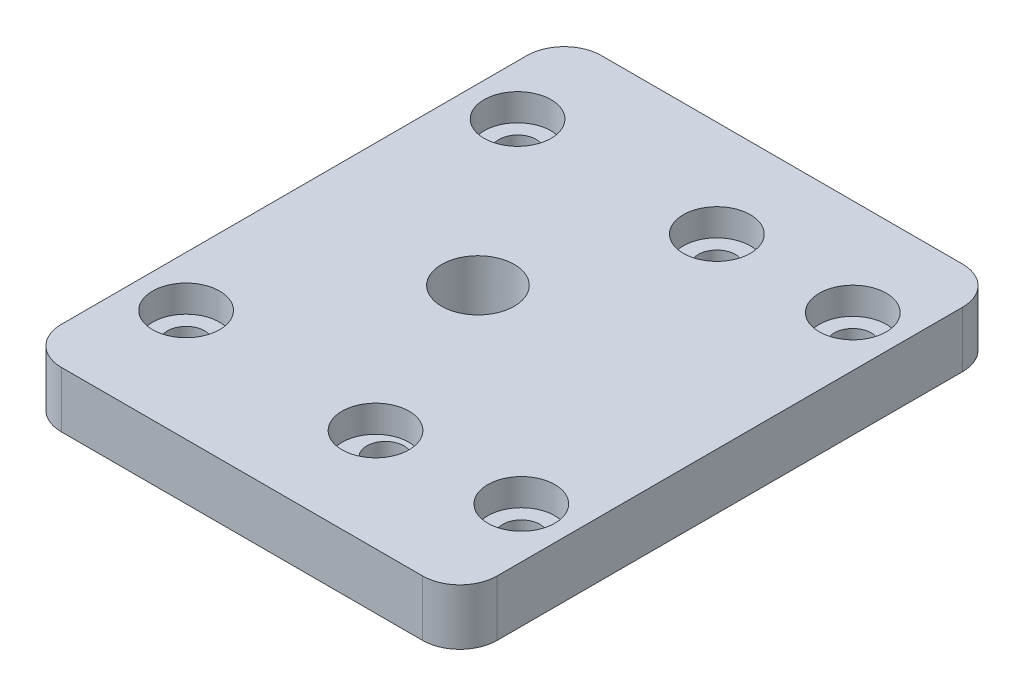
ISO-10303-21;
HEADER;
FILE_DESCRIPTION(('STEP AP214'),'2;1');
FILE_NAME('part.step','',(''),(''),'','','');
FILE_SCHEMA(('AUTOMOTIVE_DESIGN { 1 0 10303 214 1 1 1 1 }'));
ENDSEC;
DATA;
#1=APPLICATION_CONTEXT('core data for automotive mechanical design processes');
#2=APPLICATION_PROTOCOL_DEFINITION('international standard','automotive_design',2000,#1);
#3=PRODUCT_CONTEXT('',#1,'mechanical');
#4=PRODUCT('Part','Part','',(#3));
#5=PRODUCT_RELATED_PRODUCT_CATEGORY('part','',(#4));
#6=PRODUCT_DEFINITION_FORMATION('','',#4);
#7=PRODUCT_DEFINITION_CONTEXT('part definition',#1,'design');
#8=PRODUCT_DEFINITION('design','',#6,#7);
#9=PRODUCT_DEFINITION_SHAPE('','',#8);
#10=(LENGTH_UNIT() NAMED_UNIT(*) SI_UNIT(.MILLI.,.METRE.));
#11=(NAMED_UNIT(*) PLANE_ANGLE_UNIT() SI_UNIT($,.RADIAN.));
#12=(NAMED_UNIT(*) SI_UNIT($,.STERADIAN.) SOLID_ANGLE_UNIT());
#13=UNCERTAINTY_MEASURE_WITH_UNIT(LENGTH_MEASURE(1.E-05),#10,'distance_accuracy_value','');
#14=(GEOMETRIC_REPRESENTATION_CONTEXT(3) GLOBAL_UNCERTAINTY_ASSIGNED_CONTEXT((#13)) GLOBAL_UNIT_ASSIGNED_CONTEXT((#10,
#11,#12)) REPRESENTATION_CONTEXT('',''));
#15=CARTESIAN_POINT('',(0.,0.,0.));
#16=DIRECTION('',(0.,0.,1.));
#17=DIRECTION('',(1.,0.,0.));
#18=AXIS2_PLACEMENT_3D('',#15,#16,#17);
#19=CARTESIAN_POINT('',(-9.,-7.,-9.3));
#20=DIRECTION('',(0.,1.,0.));
#21=DIRECTION('',(0.,0.,1.));
#22=AXIS2_PLACEMENT_3D('',#19,#20,#21);
#23=CYLINDRICAL_SURFACE('',#22,1.);
#24=CARTESIAN_POINT('',(-9.,0.,-9.3));
#25=DIRECTION('',(0.,-1.,0.));
#26=DIRECTION('',(0.,0.,-1.));
#27=AXIS2_PLACEMENT_3D('',#24,#25,#26);
#28=CIRCLE('',#27,1.);
#29=CARTESIAN_POINT('',(-9.,0.,-10.3));
#30=VERTEX_POINT('',#29);
#31=EDGE_CURVE('E169',#30,#30,#28,.T.);
#32=ORIENTED_EDGE('',*,*,#31,.T.);
#33=EDGE_LOOP('',(#32));
#34=FACE_BOUND('',#33,.T.);
#35=CARTESIAN_POINT('',(-9.,1.55,-9.3));
#36=DIRECTION('',(0.,1.,0.));
#37=DIRECTION('',(0.,0.,1.));
#38=AXIS2_PLACEMENT_3D('',#35,#36,#37);
#39=CIRCLE('',#38,1.);
#40=CARTESIAN_POINT('',(-9.,1.55,-8.3));
#41=VERTEX_POINT('',#40);
#42=EDGE_CURVE('E40',#41,#41,#39,.F.);
#43=ORIENTED_EDGE('',*,*,#42,.F.);
#44=EDGE_LOOP('',(#43));
#45=FACE_BOUND('',#44,.T.);
#46=ADVANCED_FACE('F36',(#34,#45),#23,.F.);
#47=CARTESIAN_POINT('',(1.7,-7.,-9.3));
#48=DIRECTION('',(0.,1.,0.));
#49=DIRECTION('',(0.,0.,1.));
#50=AXIS2_PLACEMENT_3D('',#47,#48,#49);
#51=CYLINDRICAL_SURFACE('',#50,1.);
#52=CARTESIAN_POINT('',(1.7,0.,-9.3));
#53=DIRECTION('',(0.,-1.,0.));
#54=DIRECTION('',(0.,0.,-1.));
#55=AXIS2_PLACEMENT_3D('',#52,#53,#54);
#56=CIRCLE('',#55,1.);
#57=CARTESIAN_POINT('',(1.7,0.,-10.3));
#58=VERTEX_POINT('',#57);
#59=EDGE_CURVE('E165',#58,#58,#56,.T.);
#60=ORIENTED_EDGE('',*,*,#59,.T.);
#61=EDGE_LOOP('',(#60));
#62=FACE_BOUND('',#61,.T.);
#63=CARTESIAN_POINT('',(1.7,1.55,-9.3));
#64=DIRECTION('',(0.,1.,0.));
#65=DIRECTION('',(0.,0.,1.));
#66=AXIS2_PLACEMENT_3D('',#63,#64,#65);
#67=CIRCLE('',#66,1.);
#68=CARTESIAN_POINT('',(1.7,1.55,-8.3));
#69=VERTEX_POINT('',#68);
#70=EDGE_CURVE('E194',#69,#69,#67,.F.);
#71=ORIENTED_EDGE('',*,*,#70,.F.);
#72=EDGE_LOOP('',(#71));
#73=FACE_BOUND('',#72,.T.);
#74=ADVANCED_FACE('F273',(#62,#73),#51,.F.);
#75=CARTESIAN_POINT('',(9.,3.,-9.3));
#76=DIRECTION('',(0.,-1.,0.));
#77=DIRECTION('',(0.,0.,-1.));
#78=AXIS2_PLACEMENT_3D('',#75,#76,#77);
#79=CYLINDRICAL_SURFACE('',#78,1.);
#80=CARTESIAN_POINT('',(9.,0.,-9.3));
#81=DIRECTION('',(0.,1.,0.));
#82=DIRECTION('',(0.,0.,1.));
#83=AXIS2_PLACEMENT_3D('',#80,#81,#82);
#84=CIRCLE('',#83,1.);
#85=CARTESIAN_POINT('',(9.,0.,-8.3));
#86=VERTEX_POINT('',#85);
#87=EDGE_CURVE('E231',#86,#86,#84,.T.);
#88=ORIENTED_EDGE('',*,*,#87,.F.);
#89=EDGE_LOOP('',(#88));
#90=FACE_BOUND('',#89,.T.);
#91=CARTESIAN_POINT('',(9.,1.55,-9.3));
#92=DIRECTION('',(0.,1.,0.));
#93=DIRECTION('',(0.,0.,1.));
#94=AXIS2_PLACEMENT_3D('',#91,#92,#93);
#95=CIRCLE('',#94,1.);
#96=CARTESIAN_POINT('',(9.,1.55,-8.3));
#97=VERTEX_POINT('',#96);
#98=EDGE_CURVE('E190',#97,#97,#95,.T.);
#99=ORIENTED_EDGE('',*,*,#98,.T.);
#100=EDGE_LOOP('',(#99));
#101=FACE_BOUND('',#100,.T.);
#102=ADVANCED_FACE('F279',(#90,#101),#79,.F.);
#103=CARTESIAN_POINT('',(9.,3.,8.5));
#104=DIRECTION('',(0.,-1.,0.));
#105=DIRECTION('',(0.,0.,-1.));
#106=AXIS2_PLACEMENT_3D('',#103,#104,#105);
#107=CYLINDRICAL_SURFACE('',#106,1.);
#108=CARTESIAN_POINT('',(9.,0.,8.5));
#109=DIRECTION('',(0.,1.,0.));
#110=DIRECTION('',(0.,0.,-1.));
#111=AXIS2_PLACEMENT_3D('',#108,#109,#110);
#112=CIRCLE('',#111,1.);
#113=CARTESIAN_POINT('',(9.,0.,7.5));
#114=VERTEX_POINT('',#113);
#115=EDGE_CURVE('E137',#114,#114,#112,.T.);
#116=ORIENTED_EDGE('',*,*,#115,.F.);
#117=EDGE_LOOP('',(#116));
#118=FACE_BOUND('',#117,.T.);
#119=CARTESIAN_POINT('',(9.,1.55,8.5));
#120=DIRECTION('',(0.,1.,0.));
#121=DIRECTION('',(0.,0.,1.));
#122=AXIS2_PLACEMENT_3D('',#119,#120,#121);
#123=CIRCLE('',#122,1.);
#124=CARTESIAN_POINT('',(9.,1.55,9.5));
#125=VERTEX_POINT('',#124);
#126=EDGE_CURVE('E185',#125,#125,#123,.T.);
#127=ORIENTED_EDGE('',*,*,#126,.T.);
#128=EDGE_LOOP('',(#127));
#129=FACE_BOUND('',#128,.T.);
#130=ADVANCED_FACE('F289',(#118,#129),#107,.F.);
#131=CARTESIAN_POINT('',(1.7,3.,8.5));
#132=DIRECTION('',(0.,-1.,0.));
#133=DIRECTION('',(0.,0.,-1.));
#134=AXIS2_PLACEMENT_3D('',#131,#132,#133);
#135=CYLINDRICAL_SURFACE('',#134,1.);
#136=CARTESIAN_POINT('',(1.7,0.,8.5));
#137=DIRECTION('',(0.,1.,0.));
#138=DIRECTION('',(0.,0.,-1.));
#139=AXIS2_PLACEMENT_3D('',#136,#137,#138);
#140=CIRCLE('',#139,1.);
#141=CARTESIAN_POINT('',(1.7,0.,7.5));
#142=VERTEX_POINT('',#141);
#143=EDGE_CURVE('E168',#142,#142,#140,.T.);
#144=ORIENTED_EDGE('',*,*,#143,.F.);
#145=EDGE_LOOP('',(#144));
#146=FACE_BOUND('',#145,.T.);
#147=CARTESIAN_POINT('',(1.7,1.55,8.5));
#148=DIRECTION('',(0.,1.,0.));
#149=DIRECTION('',(0.,0.,1.));
#150=AXIS2_PLACEMENT_3D('',#147,#148,#149);
#151=CIRCLE('',#150,1.);
#152=CARTESIAN_POINT('',(1.7,1.55,9.5));
#153=VERTEX_POINT('',#152);
#154=EDGE_CURVE('E180',#153,#153,#151,.T.);
#155=ORIENTED_EDGE('',*,*,#154,.T.);
#156=EDGE_LOOP('',(#155));
#157=FACE_BOUND('',#156,.T.);
#158=ADVANCED_FACE('F285',(#146,#157),#135,.F.);
#159=CARTESIAN_POINT('',(-9.,3.,8.5));
#160=DIRECTION('',(0.,-1.,0.));
#161=DIRECTION('',(0.,0.,-1.));
#162=AXIS2_PLACEMENT_3D('',#159,#160,#161);
#163=CYLINDRICAL_SURFACE('',#162,1.);
#164=CARTESIAN_POINT('',(-9.,0.,8.5));
#165=DIRECTION('',(0.,1.,0.));
#166=DIRECTION('',(0.,0.,-1.));
#167=AXIS2_PLACEMENT_3D('',#164,#165,#166);
#168=CIRCLE('',#167,1.);
#169=CARTESIAN_POINT('',(-9.,0.,7.5));
#170=VERTEX_POINT('',#169);
#171=EDGE_CURVE('E234',#170,#170,#168,.T.);
#172=ORIENTED_EDGE('',*,*,#171,.F.);
#173=EDGE_LOOP('',(#172));
#174=FACE_BOUND('',#173,.T.);
#175=CARTESIAN_POINT('',(-9.,1.55,8.5));
#176=DIRECTION('',(0.,1.,0.));
#177=DIRECTION('',(0.,0.,1.));
#178=AXIS2_PLACEMENT_3D('',#175,#176,#177);
#179=CIRCLE('',#178,1.);
#180=CARTESIAN_POINT('',(-9.,1.55,9.5));
#181=VERTEX_POINT('',#180);
#182=EDGE_CURVE('E176',#181,#181,#179,.T.);
#183=ORIENTED_EDGE('',*,*,#182,.T.);
#184=EDGE_LOOP('',(#183));
#185=FACE_BOUND('',#184,.T.);
#186=ADVANCED_FACE('F288',(#174,#185),#163,.F.);
#187=CARTESIAN_POINT('',(0.,3.,0.));
#188=DIRECTION('',(0.,-1.,0.));
#189=DIRECTION('',(0.,0.,-1.));
#190=AXIS2_PLACEMENT_3D('',#187,#188,#189);
#191=PLANE('',#190);
#192=CARTESIAN_POINT('',(-9.,3.,-9.3));
#193=DIRECTION('',(0.,1.,0.));
#194=DIRECTION('',(0.,0.,1.));
#195=AXIS2_PLACEMENT_3D('',#192,#193,#194);
#196=CIRCLE('',#195,1.8);
#197=CARTESIAN_POINT('',(-9.,3.,-7.5));
#198=VERTEX_POINT('',#197);
#199=EDGE_CURVE('E210',#198,#198,#196,.T.);
#200=ORIENTED_EDGE('',*,*,#199,.F.);
#201=EDGE_LOOP('',(#200));
#202=FACE_BOUND('',#201,.T.);
#203=CARTESIAN_POINT('',(1.7,3.,-9.3));
#204=DIRECTION('',(0.,1.,0.));
#205=DIRECTION('',(0.,0.,1.));
#206=AXIS2_PLACEMENT_3D('',#203,#204,#205);
#207=CIRCLE('',#206,1.8);
#208=CARTESIAN_POINT('',(1.7,3.,-7.5));
#209=VERTEX_POINT('',#208);
#210=EDGE_CURVE('E203',#209,#209,#207,.T.);
#211=ORIENTED_EDGE('',*,*,#210,.F.);
#212=EDGE_LOOP('',(#211));
#213=FACE_BOUND('',#212,.T.);
#214=CARTESIAN_POINT('',(9.,3.,-9.3));
#215=DIRECTION('',(0.,1.,0.));
#216=DIRECTION('',(0.,0.,1.));
#217=AXIS2_PLACEMENT_3D('',#214,#215,#216);
#218=CIRCLE('',#217,1.8);
#219=CARTESIAN_POINT('',(9.,3.,-7.5));
#220=VERTEX_POINT('',#219);
#221=EDGE_CURVE('E196',#220,#220,#218,.T.);
#222=ORIENTED_EDGE('',*,*,#221,.F.);
#223=EDGE_LOOP('',(#222));
#224=FACE_BOUND('',#223,.T.);
#225=CARTESIAN_POINT('',(9.,3.,8.5));
#226=DIRECTION('',(0.,1.,0.));
#227=DIRECTION('',(0.,0.,1.));
#228=AXIS2_PLACEMENT_3D('',#225,#226,#227);
#229=CIRCLE('',#228,1.8);
#230=CARTESIAN_POINT('',(9.,3.,10.3));
#231=VERTEX_POINT('',#230);
#232=EDGE_CURVE('E192',#231,#231,#229,.T.);
#233=ORIENTED_EDGE('',*,*,#232,.F.);
#234=EDGE_LOOP('',(#233));
#235=FACE_BOUND('',#234,.T.);
#236=CARTESIAN_POINT('',(1.67182258337982,3.,9.00000000000064));
#237=DIRECTION('',(0.,1.,0.));
#238=DIRECTION('',(0.,0.,1.));
#239=AXIS2_PLACEMENT_3D('',#236,#237,#238);
#240=CIRCLE('',#239,1.8);
#241=CARTESIAN_POINT('',(1.67182258337982,3.,10.8000000000006));
#242=VERTEX_POINT('',#241);
#243=EDGE_CURVE('E188',#242,#242,#240,.T.);
#244=ORIENTED_EDGE('',*,*,#243,.F.);
#245=EDGE_LOOP('',(#244));
#246=FACE_BOUND('',#245,.T.);
#247=CARTESIAN_POINT('',(-9.,3.,8.5));
#248=DIRECTION('',(0.,1.,0.));
#249=DIRECTION('',(0.,0.,1.));
#250=AXIS2_PLACEMENT_3D('',#247,#248,#249);
#251=CIRCLE('',#250,1.8);
#252=CARTESIAN_POINT('',(-9.,3.,10.3));
#253=VERTEX_POINT('',#252);
#254=EDGE_CURVE('E183',#253,#253,#251,.T.);
#255=ORIENTED_EDGE('',*,*,#254,.F.);
#256=EDGE_LOOP('',(#255));
#257=FACE_BOUND('',#256,.T.);
#258=CARTESIAN_POINT('',(-2.3281774166205,3.,-0.499999999999999));
#259=DIRECTION('',(0.,1.,0.));
#260=DIRECTION('',(0.,0.,1.));
#261=AXIS2_PLACEMENT_3D('',#258,#259,#260);
#262=CIRCLE('',#261,1.95);
#263=CARTESIAN_POINT('',(-2.3281774166205,3.,1.45));
#264=VERTEX_POINT('',#263);
#265=EDGE_CURVE('E175',#264,#264,#262,.T.);
#266=ORIENTED_EDGE('',*,*,#265,.F.);
#267=EDGE_LOOP('',(#266));
#268=FACE_BOUND('',#267,.T.);
#269=DIRECTION('',(0.,0.,-1.));
#270=VECTOR('',#269,1.);
#271=CARTESIAN_POINT('',(11.7,3.,14.5));
#272=LINE('',#271,#270);
#273=CARTESIAN_POINT('',(11.7,3.,12.5));
#274=VERTEX_POINT('',#273);
#275=CARTESIAN_POINT('',(11.7,3.,-12.5));
#276=VERTEX_POINT('',#275);
#277=EDGE_CURVE('E142',#274,#276,#272,.T.);
#278=ORIENTED_EDGE('',*,*,#277,.T.);
#279=CARTESIAN_POINT('',(9.69999999999999,3.,-12.5));
#280=DIRECTION('',(0.,-1.,0.));
#281=DIRECTION('',(0.,0.,-1.));
#282=AXIS2_PLACEMENT_3D('',#279,#280,#281);
#283=CIRCLE('',#282,2.);
#284=CARTESIAN_POINT('',(9.69999999999999,3.,-14.5));
#285=VERTEX_POINT('',#284);
#286=EDGE_CURVE('E157',#276,#285,#283,.F.);
#287=ORIENTED_EDGE('',*,*,#286,.T.);
#288=DIRECTION('',(-1.,0.,0.));
#289=VECTOR('',#288,1.);
#290=CARTESIAN_POINT('',(-11.7,3.,-14.5));
#291=LINE('',#290,#289);
#292=CARTESIAN_POINT('',(-9.7,3.,-14.5));
#293=VERTEX_POINT('',#292);
#294=EDGE_CURVE('E124',#285,#293,#291,.T.);
#295=ORIENTED_EDGE('',*,*,#294,.T.);
#296=CARTESIAN_POINT('',(-9.7,3.,-12.5));
#297=DIRECTION('',(0.,-1.,0.));
#298=DIRECTION('',(0.,0.,-1.));
#299=AXIS2_PLACEMENT_3D('',#296,#297,#298);
#300=CIRCLE('',#299,2.);
#301=CARTESIAN_POINT('',(-11.7,3.,-12.5));
#302=VERTEX_POINT('',#301);
#303=EDGE_CURVE('E152',#293,#302,#300,.F.);
#304=ORIENTED_EDGE('',*,*,#303,.T.);
#305=DIRECTION('',(0.,0.,1.));
#306=VECTOR('',#305,1.);
#307=CARTESIAN_POINT('',(-11.7,3.,14.5));
#308=LINE('',#307,#306);
#309=CARTESIAN_POINT('',(-11.7,3.,12.5));
#310=VERTEX_POINT('',#309);
#311=EDGE_CURVE('E242',#302,#310,#308,.T.);
#312=ORIENTED_EDGE('',*,*,#311,.T.);
#313=CARTESIAN_POINT('',(-9.7,3.,12.5));
#314=DIRECTION('',(0.,-1.,0.));
#315=DIRECTION('',(0.,0.,-1.));
#316=AXIS2_PLACEMENT_3D('',#313,#314,#315);
#317=CIRCLE('',#316,2.);
#318=CARTESIAN_POINT('',(-9.7,3.,14.5));
#319=VERTEX_POINT('',#318);
#320=EDGE_CURVE('E60',#310,#319,#317,.F.);
#321=ORIENTED_EDGE('',*,*,#320,.T.);
#322=DIRECTION('',(1.,0.,0.));
#323=VECTOR('',#322,1.);
#324=CARTESIAN_POINT('',(-11.7,3.,14.5));
#325=LINE('',#324,#323);
#326=CARTESIAN_POINT('',(9.69999999999999,3.,14.5));
#327=VERTEX_POINT('',#326);
#328=EDGE_CURVE('E143',#319,#327,#325,.T.);
#329=ORIENTED_EDGE('',*,*,#328,.T.);
#330=CARTESIAN_POINT('',(9.7,3.,12.5));
#331=DIRECTION('',(0.,-1.,0.));
#332=DIRECTION('',(0.,0.,-1.));
#333=AXIS2_PLACEMENT_3D('',#330,#331,#332);
#334=CIRCLE('',#333,2.);
#335=EDGE_CURVE('E155',#327,#274,#334,.F.);
#336=ORIENTED_EDGE('',*,*,#335,.T.);
#337=EDGE_LOOP('',(#278,#287,#295,#304,#312,#321,#329,#336));
#338=FACE_BOUND('',#337,.T.);
#339=ADVANCED_FACE('F244',(#202,#213,#224,#235,#246,#257,#268,#338),#191,.F.);
#340=CARTESIAN_POINT('',(0.,0.,0.));
#341=DIRECTION('',(0.,-1.,0.));
#342=DIRECTION('',(0.,0.,-1.));
#343=AXIS2_PLACEMENT_3D('',#340,#341,#342);
#344=PLANE('',#343);
#345=CARTESIAN_POINT('',(-2.3281774166205,0.,-0.499999999999999));
#346=DIRECTION('',(0.,-1.,0.));
#347=DIRECTION('',(0.,0.,-1.));
#348=AXIS2_PLACEMENT_3D('',#345,#346,#347);
#349=CIRCLE('',#348,1.95);
#350=CARTESIAN_POINT('',(-2.3281774166205,0.,-2.45));
#351=VERTEX_POINT('',#350);
#352=EDGE_CURVE('E172',#351,#351,#349,.T.);
#353=ORIENTED_EDGE('',*,*,#352,.F.);
#354=EDGE_LOOP('',(#353));
#355=FACE_BOUND('',#354,.T.);
#356=ORIENTED_EDGE('',*,*,#31,.F.);
#357=EDGE_LOOP('',(#356));
#358=FACE_BOUND('',#357,.T.);
#359=ORIENTED_EDGE('',*,*,#59,.F.);
#360=EDGE_LOOP('',(#359));
#361=FACE_BOUND('',#360,.T.);
#362=ORIENTED_EDGE('',*,*,#87,.T.);
#363=EDGE_LOOP('',(#362));
#364=FACE_BOUND('',#363,.T.);
#365=ORIENTED_EDGE('',*,*,#115,.T.);
#366=EDGE_LOOP('',(#365));
#367=FACE_BOUND('',#366,.T.);
#368=DIRECTION('',(-1.,0.,0.));
#369=VECTOR('',#368,1.);
#370=CARTESIAN_POINT('',(-11.7,0.,-14.5));
#371=LINE('',#370,#369);
#372=CARTESIAN_POINT('',(9.69999999999999,0.,-14.5));
#373=VERTEX_POINT('',#372);
#374=CARTESIAN_POINT('',(-9.7,0.,-14.5));
#375=VERTEX_POINT('',#374);
#376=EDGE_CURVE('E121',#373,#375,#371,.T.);
#377=ORIENTED_EDGE('',*,*,#376,.F.);
#378=CARTESIAN_POINT('',(9.69999999999999,0.,-12.5));
#379=DIRECTION('',(0.,-1.,0.));
#380=DIRECTION('',(0.,0.,-1.));
#381=AXIS2_PLACEMENT_3D('',#378,#379,#380);
#382=CIRCLE('',#381,2.);
#383=CARTESIAN_POINT('',(11.7,0.,-12.5));
#384=VERTEX_POINT('',#383);
#385=EDGE_CURVE('E104',#373,#384,#382,.T.);
#386=ORIENTED_EDGE('',*,*,#385,.T.);
#387=DIRECTION('',(0.,0.,-1.));
#388=VECTOR('',#387,1.);
#389=CARTESIAN_POINT('',(11.7,0.,14.5));
#390=LINE('',#389,#388);
#391=CARTESIAN_POINT('',(11.7,0.,12.5));
#392=VERTEX_POINT('',#391);
#393=EDGE_CURVE('E132',#392,#384,#390,.T.);
#394=ORIENTED_EDGE('',*,*,#393,.F.);
#395=CARTESIAN_POINT('',(9.7,0.,12.5));
#396=DIRECTION('',(0.,-1.,0.));
#397=DIRECTION('',(0.,0.,-1.));
#398=AXIS2_PLACEMENT_3D('',#395,#396,#397);
#399=CIRCLE('',#398,2.);
#400=CARTESIAN_POINT('',(9.69999999999999,0.,14.5));
#401=VERTEX_POINT('',#400);
#402=EDGE_CURVE('E115',#392,#401,#399,.T.);
#403=ORIENTED_EDGE('',*,*,#402,.T.);
#404=DIRECTION('',(1.,0.,0.));
#405=VECTOR('',#404,1.);
#406=CARTESIAN_POINT('',(-11.7,0.,14.5));
#407=LINE('',#406,#405);
#408=CARTESIAN_POINT('',(-9.7,0.,14.5));
#409=VERTEX_POINT('',#408);
#410=EDGE_CURVE('E135',#409,#401,#407,.T.);
#411=ORIENTED_EDGE('',*,*,#410,.F.);
#412=CARTESIAN_POINT('',(-9.7,0.,12.5));
#413=DIRECTION('',(0.,-1.,0.));
#414=DIRECTION('',(0.,0.,-1.));
#415=AXIS2_PLACEMENT_3D('',#412,#413,#414);
#416=CIRCLE('',#415,2.);
#417=CARTESIAN_POINT('',(-11.7,0.,12.5));
#418=VERTEX_POINT('',#417);
#419=EDGE_CURVE('E146',#409,#418,#416,.T.);
#420=ORIENTED_EDGE('',*,*,#419,.T.);
#421=DIRECTION('',(0.,0.,1.));
#422=VECTOR('',#421,1.);
#423=CARTESIAN_POINT('',(-11.7,0.,14.5));
#424=LINE('',#423,#422);
#425=CARTESIAN_POINT('',(-11.7,0.,-12.5));
#426=VERTEX_POINT('',#425);
#427=EDGE_CURVE('E131',#426,#418,#424,.T.);
#428=ORIENTED_EDGE('',*,*,#427,.F.);
#429=CARTESIAN_POINT('',(-9.7,0.,-12.5));
#430=DIRECTION('',(0.,-1.,0.));
#431=DIRECTION('',(0.,0.,-1.));
#432=AXIS2_PLACEMENT_3D('',#429,#430,#431);
#433=CIRCLE('',#432,2.);
#434=EDGE_CURVE('E125',#426,#375,#433,.T.);
#435=ORIENTED_EDGE('',*,*,#434,.T.);
#436=EDGE_LOOP('',(#377,#386,#394,#403,#411,#420,#428,#435));
#437=FACE_BOUND('',#436,.T.);
#438=ORIENTED_EDGE('',*,*,#171,.T.);
#439=EDGE_LOOP('',(#438));
#440=FACE_BOUND('',#439,.T.);
#441=ORIENTED_EDGE('',*,*,#143,.T.);
#442=EDGE_LOOP('',(#441));
#443=FACE_BOUND('',#442,.T.);
#444=ADVANCED_FACE('F128',(#355,#358,#361,#364,#367,#437,#440,#443),#344,.T.);
#445=CARTESIAN_POINT('',(11.7,3.,14.5));
#446=DIRECTION('',(-1.,0.,0.));
#447=DIRECTION('',(0.,0.,1.));
#448=AXIS2_PLACEMENT_3D('',#445,#446,#447);
#449=PLANE('',#448);
#450=ORIENTED_EDGE('',*,*,#393,.T.);
#451=DIRECTION('',(0.,-1.,0.));
#452=VECTOR('',#451,1.);
#453=CARTESIAN_POINT('',(11.7,3.,-12.5));
#454=LINE('',#453,#452);
#455=EDGE_CURVE('E109',#384,#276,#454,.F.);
#456=ORIENTED_EDGE('',*,*,#455,.T.);
#457=ORIENTED_EDGE('',*,*,#277,.F.);
#458=DIRECTION('',(0.,-1.,0.));
#459=VECTOR('',#458,1.);
#460=CARTESIAN_POINT('',(11.7,3.,12.5));
#461=LINE('',#460,#459);
#462=EDGE_CURVE('E114',#274,#392,#461,.T.);
#463=ORIENTED_EDGE('',*,*,#462,.T.);
#464=EDGE_LOOP('',(#450,#456,#457,#463));
#465=FACE_BOUND('',#464,.T.);
#466=ADVANCED_FACE('F251',(#465),#449,.F.);
#467=CARTESIAN_POINT('',(-11.7,3.,-14.5));
#468=DIRECTION('',(0.,0.,1.));
#469=DIRECTION('',(1.,0.,0.));
#470=AXIS2_PLACEMENT_3D('',#467,#468,#469);
#471=PLANE('',#470);
#472=ORIENTED_EDGE('',*,*,#294,.F.);
#473=DIRECTION('',(0.,-1.,0.));
#474=VECTOR('',#473,1.);
#475=CARTESIAN_POINT('',(9.69999999999999,3.,-14.5));
#476=LINE('',#475,#474);
#477=EDGE_CURVE('E108',#285,#373,#476,.T.);
#478=ORIENTED_EDGE('',*,*,#477,.T.);
#479=ORIENTED_EDGE('',*,*,#376,.T.);
#480=DIRECTION('',(0.,-1.,0.));
#481=VECTOR('',#480,1.);
#482=CARTESIAN_POINT('',(-9.7,3.,-14.5));
#483=LINE('',#482,#481);
#484=EDGE_CURVE('E126',#375,#293,#483,.F.);
#485=ORIENTED_EDGE('',*,*,#484,.T.);
#486=EDGE_LOOP('',(#472,#478,#479,#485));
#487=FACE_BOUND('',#486,.T.);
#488=ADVANCED_FACE('F120',(#487),#471,.F.);
#489=CARTESIAN_POINT('',(-11.7,3.,14.5));
#490=DIRECTION('',(1.,0.,0.));
#491=DIRECTION('',(0.,0.,-1.));
#492=AXIS2_PLACEMENT_3D('',#489,#490,#491);
#493=PLANE('',#492);
#494=ORIENTED_EDGE('',*,*,#427,.T.);
#495=DIRECTION('',(0.,-1.,0.));
#496=VECTOR('',#495,1.);
#497=CARTESIAN_POINT('',(-11.7,3.,12.5));
#498=LINE('',#497,#496);
#499=EDGE_CURVE('E11',#418,#310,#498,.F.);
#500=ORIENTED_EDGE('',*,*,#499,.T.);
#501=ORIENTED_EDGE('',*,*,#311,.F.);
#502=DIRECTION('',(0.,-1.,0.));
#503=VECTOR('',#502,1.);
#504=CARTESIAN_POINT('',(-11.7,3.,-12.5));
#505=LINE('',#504,#503);
#506=EDGE_CURVE('E45',#302,#426,#505,.T.);
#507=ORIENTED_EDGE('',*,*,#506,.T.);
#508=EDGE_LOOP('',(#494,#500,#501,#507));
#509=FACE_BOUND('',#508,.T.);
#510=ADVANCED_FACE('F258',(#509),#493,.F.);
#511=CARTESIAN_POINT('',(-11.7,3.,14.5));
#512=DIRECTION('',(0.,0.,-1.));
#513=DIRECTION('',(-1.,0.,0.));
#514=AXIS2_PLACEMENT_3D('',#511,#512,#513);
#515=PLANE('',#514);
#516=ORIENTED_EDGE('',*,*,#410,.T.);
#517=DIRECTION('',(0.,-1.,0.));
#518=VECTOR('',#517,1.);
#519=CARTESIAN_POINT('',(9.69999999999999,3.,14.5));
#520=LINE('',#519,#518);
#521=EDGE_CURVE('E53',#401,#327,#520,.F.);
#522=ORIENTED_EDGE('',*,*,#521,.T.);
#523=ORIENTED_EDGE('',*,*,#328,.F.);
#524=DIRECTION('',(0.,-1.,0.));
#525=VECTOR('',#524,1.);
#526=CARTESIAN_POINT('',(-9.7,3.,14.5));
#527=LINE('',#526,#525);
#528=EDGE_CURVE('E159',#319,#409,#527,.T.);
#529=ORIENTED_EDGE('',*,*,#528,.T.);
#530=EDGE_LOOP('',(#516,#522,#523,#529));
#531=FACE_BOUND('',#530,.T.);
#532=ADVANCED_FACE('F253',(#531),#515,.F.);
#533=CARTESIAN_POINT('',(9.69999999999999,3.,-12.5));
#534=DIRECTION('',(0.,-1.,0.));
#535=DIRECTION('',(0.,0.,-1.));
#536=AXIS2_PLACEMENT_3D('',#533,#534,#535);
#537=CYLINDRICAL_SURFACE('',#536,2.);
#538=ORIENTED_EDGE('',*,*,#286,.F.);
#539=ORIENTED_EDGE('',*,*,#455,.F.);
#540=ORIENTED_EDGE('',*,*,#385,.F.);
#541=ORIENTED_EDGE('',*,*,#477,.F.);
#542=EDGE_LOOP('',(#538,#539,#540,#541));
#543=FACE_BOUND('',#542,.T.);
#544=ADVANCED_FACE('F107',(#543),#537,.T.);
#545=CARTESIAN_POINT('',(9.7,3.,12.5));
#546=DIRECTION('',(0.,-1.,0.));
#547=DIRECTION('',(0.,0.,-1.));
#548=AXIS2_PLACEMENT_3D('',#545,#546,#547);
#549=CYLINDRICAL_SURFACE('',#548,2.);
#550=ORIENTED_EDGE('',*,*,#335,.F.);
#551=ORIENTED_EDGE('',*,*,#521,.F.);
#552=ORIENTED_EDGE('',*,*,#402,.F.);
#553=ORIENTED_EDGE('',*,*,#462,.F.);
#554=EDGE_LOOP('',(#550,#551,#552,#553));
#555=FACE_BOUND('',#554,.T.);
#556=ADVANCED_FACE('F249',(#555),#549,.T.);
#557=CARTESIAN_POINT('',(-9.7,3.,12.5));
#558=DIRECTION('',(0.,-1.,0.));
#559=DIRECTION('',(0.,0.,-1.));
#560=AXIS2_PLACEMENT_3D('',#557,#558,#559);
#561=CYLINDRICAL_SURFACE('',#560,2.);
#562=ORIENTED_EDGE('',*,*,#320,.F.);
#563=ORIENTED_EDGE('',*,*,#499,.F.);
#564=ORIENTED_EDGE('',*,*,#419,.F.);
#565=ORIENTED_EDGE('',*,*,#528,.F.);
#566=EDGE_LOOP('',(#562,#563,#564,#565));
#567=FACE_BOUND('',#566,.T.);
#568=ADVANCED_FACE('F255',(#567),#561,.T.);
#569=CARTESIAN_POINT('',(-9.7,3.,-12.5));
#570=DIRECTION('',(0.,-1.,0.));
#571=DIRECTION('',(0.,0.,-1.));
#572=AXIS2_PLACEMENT_3D('',#569,#570,#571);
#573=CYLINDRICAL_SURFACE('',#572,2.);
#574=ORIENTED_EDGE('',*,*,#303,.F.);
#575=ORIENTED_EDGE('',*,*,#484,.F.);
#576=ORIENTED_EDGE('',*,*,#434,.F.);
#577=ORIENTED_EDGE('',*,*,#506,.F.);
#578=EDGE_LOOP('',(#574,#575,#576,#577));
#579=FACE_BOUND('',#578,.T.);
#580=ADVANCED_FACE('F38',(#579),#573,.T.);
#581=CARTESIAN_POINT('',(-2.3281774166205,-7.,-0.499999999999999));
#582=DIRECTION('',(0.,1.,0.));
#583=DIRECTION('',(0.,0.,1.));
#584=AXIS2_PLACEMENT_3D('',#581,#582,#583);
#585=CYLINDRICAL_SURFACE('',#584,1.95);
#586=ORIENTED_EDGE('',*,*,#352,.T.);
#587=EDGE_LOOP('',(#586));
#588=FACE_BOUND('',#587,.T.);
#589=ORIENTED_EDGE('',*,*,#265,.T.);
#590=EDGE_LOOP('',(#589));
#591=FACE_BOUND('',#590,.T.);
#592=ADVANCED_FACE('F264',(#588,#591),#585,.F.);
#593=CARTESIAN_POINT('',(-9.,1.55,8.5));
#594=DIRECTION('',(0.,1.,0.));
#595=DIRECTION('',(0.,0.,1.));
#596=AXIS2_PLACEMENT_3D('',#593,#594,#595);
#597=CYLINDRICAL_SURFACE('',#596,1.8);
#598=CARTESIAN_POINT('',(-9.,1.55,8.5));
#599=DIRECTION('',(0.,1.,0.));
#600=DIRECTION('',(0.,0.,1.));
#601=AXIS2_PLACEMENT_3D('',#598,#599,#600);
#602=CIRCLE('',#601,1.8);
#603=CARTESIAN_POINT('',(-9.,1.55,10.3));
#604=VERTEX_POINT('',#603);
#605=EDGE_CURVE('E179',#604,#604,#602,.T.);
#606=ORIENTED_EDGE('',*,*,#605,.F.);
#607=EDGE_LOOP('',(#606));
#608=FACE_BOUND('',#607,.T.);
#609=ORIENTED_EDGE('',*,*,#254,.T.);
#610=EDGE_LOOP('',(#609));
#611=FACE_BOUND('',#610,.T.);
#612=ADVANCED_FACE('F269',(#608,#611),#597,.F.);
#613=CARTESIAN_POINT('',(-9.,1.55,8.5));
#614=DIRECTION('',(0.,1.,0.));
#615=DIRECTION('',(0.,0.,1.));
#616=AXIS2_PLACEMENT_3D('',#613,#614,#615);
#617=PLANE('',#616);
#618=ORIENTED_EDGE('',*,*,#182,.F.);
#619=EDGE_LOOP('',(#618));
#620=FACE_BOUND('',#619,.T.);
#621=ORIENTED_EDGE('',*,*,#605,.T.);
#622=EDGE_LOOP('',(#621));
#623=FACE_BOUND('',#622,.T.);
#624=ADVANCED_FACE('F391',(#620,#623),#617,.T.);
#625=CARTESIAN_POINT('',(1.67182258337982,1.55,9.00000000000064));
#626=DIRECTION('',(0.,1.,0.));
#627=DIRECTION('',(0.,0.,1.));
#628=AXIS2_PLACEMENT_3D('',#625,#626,#627);
#629=CYLINDRICAL_SURFACE('',#628,1.8);
#630=CARTESIAN_POINT('',(1.67182258337982,1.55,9.00000000000064));
#631=DIRECTION('',(0.,1.,0.));
#632=DIRECTION('',(0.,0.,1.));
#633=AXIS2_PLACEMENT_3D('',#630,#631,#632);
#634=CIRCLE('',#633,1.8);
#635=CARTESIAN_POINT('',(1.67182258337982,1.55,10.8000000000006));
#636=VERTEX_POINT('',#635);
#637=EDGE_CURVE('E184',#636,#636,#634,.T.);
#638=ORIENTED_EDGE('',*,*,#637,.F.);
#639=EDGE_LOOP('',(#638));
#640=FACE_BOUND('',#639,.T.);
#641=ORIENTED_EDGE('',*,*,#243,.T.);
#642=EDGE_LOOP('',(#641));
#643=FACE_BOUND('',#642,.T.);
#644=ADVANCED_FACE('F400',(#640,#643),#629,.F.);
#645=CARTESIAN_POINT('',(1.67182258337982,1.55,9.00000000000064));
#646=DIRECTION('',(0.,1.,0.));
#647=DIRECTION('',(0.,0.,1.));
#648=AXIS2_PLACEMENT_3D('',#645,#646,#647);
#649=PLANE('',#648);
#650=ORIENTED_EDGE('',*,*,#154,.F.);
#651=EDGE_LOOP('',(#650));
#652=FACE_BOUND('',#651,.T.);
#653=ORIENTED_EDGE('',*,*,#637,.T.);
#654=EDGE_LOOP('',(#653));
#655=FACE_BOUND('',#654,.T.);
#656=ADVANCED_FACE('F410',(#652,#655),#649,.T.);
#657=CARTESIAN_POINT('',(9.,1.55,8.5));
#658=DIRECTION('',(0.,1.,0.));
#659=DIRECTION('',(0.,0.,1.));
#660=AXIS2_PLACEMENT_3D('',#657,#658,#659);
#661=CYLINDRICAL_SURFACE('',#660,1.8);
#662=CARTESIAN_POINT('',(9.,1.55,8.5));
#663=DIRECTION('',(0.,1.,0.));
#664=DIRECTION('',(0.,0.,1.));
#665=AXIS2_PLACEMENT_3D('',#662,#663,#664);
#666=CIRCLE('',#665,1.8);
#667=CARTESIAN_POINT('',(9.,1.55,10.3));
#668=VERTEX_POINT('',#667);
#669=EDGE_CURVE('E189',#668,#668,#666,.T.);
#670=ORIENTED_EDGE('',*,*,#669,.F.);
#671=EDGE_LOOP('',(#670));
#672=FACE_BOUND('',#671,.T.);
#673=ORIENTED_EDGE('',*,*,#232,.T.);
#674=EDGE_LOOP('',(#673));
#675=FACE_BOUND('',#674,.T.);
#676=ADVANCED_FACE('F420',(#672,#675),#661,.F.);
#677=CARTESIAN_POINT('',(9.,1.55,8.5));
#678=DIRECTION('',(0.,1.,0.));
#679=DIRECTION('',(0.,0.,1.));
#680=AXIS2_PLACEMENT_3D('',#677,#678,#679);
#681=PLANE('',#680);
#682=ORIENTED_EDGE('',*,*,#126,.F.);
#683=EDGE_LOOP('',(#682));
#684=FACE_BOUND('',#683,.T.);
#685=ORIENTED_EDGE('',*,*,#669,.T.);
#686=EDGE_LOOP('',(#685));
#687=FACE_BOUND('',#686,.T.);
#688=ADVANCED_FACE('F430',(#684,#687),#681,.T.);
#689=CARTESIAN_POINT('',(9.,1.55,-9.3));
#690=DIRECTION('',(0.,1.,0.));
#691=DIRECTION('',(0.,0.,1.));
#692=AXIS2_PLACEMENT_3D('',#689,#690,#691);
#693=CYLINDRICAL_SURFACE('',#692,1.8);
#694=CARTESIAN_POINT('',(9.,1.55,-9.3));
#695=DIRECTION('',(0.,1.,0.));
#696=DIRECTION('',(0.,0.,1.));
#697=AXIS2_PLACEMENT_3D('',#694,#695,#696);
#698=CIRCLE('',#697,1.8);
#699=CARTESIAN_POINT('',(9.,1.55,-7.5));
#700=VERTEX_POINT('',#699);
#701=EDGE_CURVE('E193',#700,#700,#698,.T.);
#702=ORIENTED_EDGE('',*,*,#701,.F.);
#703=EDGE_LOOP('',(#702));
#704=FACE_BOUND('',#703,.T.);
#705=ORIENTED_EDGE('',*,*,#221,.T.);
#706=EDGE_LOOP('',(#705));
#707=FACE_BOUND('',#706,.T.);
#708=ADVANCED_FACE('F440',(#704,#707),#693,.F.);
#709=CARTESIAN_POINT('',(9.,1.55,-9.3));
#710=DIRECTION('',(0.,1.,0.));
#711=DIRECTION('',(0.,0.,1.));
#712=AXIS2_PLACEMENT_3D('',#709,#710,#711);
#713=PLANE('',#712);
#714=ORIENTED_EDGE('',*,*,#98,.F.);
#715=EDGE_LOOP('',(#714));
#716=FACE_BOUND('',#715,.T.);
#717=ORIENTED_EDGE('',*,*,#701,.T.);
#718=EDGE_LOOP('',(#717));
#719=FACE_BOUND('',#718,.T.);
#720=ADVANCED_FACE('F450',(#716,#719),#713,.T.);
#721=CARTESIAN_POINT('',(1.7,1.55,-9.3));
#722=DIRECTION('',(0.,1.,0.));
#723=DIRECTION('',(0.,0.,1.));
#724=AXIS2_PLACEMENT_3D('',#721,#722,#723);
#725=PLANE('',#724);
#726=CARTESIAN_POINT('',(1.7,1.55,-9.3));
#727=DIRECTION('',(0.,1.,0.));
#728=DIRECTION('',(0.,0.,1.));
#729=AXIS2_PLACEMENT_3D('',#726,#727,#728);
#730=CIRCLE('',#729,1.8);
#731=CARTESIAN_POINT('',(1.7,1.55,-7.5));
#732=VERTEX_POINT('',#731);
#733=EDGE_CURVE('E197',#732,#732,#730,.T.);
#734=ORIENTED_EDGE('',*,*,#733,.T.);
#735=EDGE_LOOP('',(#734));
#736=FACE_BOUND('',#735,.T.);
#737=ORIENTED_EDGE('',*,*,#70,.T.);
#738=EDGE_LOOP('',(#737));
#739=FACE_BOUND('',#738,.T.);
#740=ADVANCED_FACE('F460',(#736,#739),#725,.T.);
#741=CARTESIAN_POINT('',(1.7,1.55,-9.3));
#742=DIRECTION('',(0.,1.,0.));
#743=DIRECTION('',(0.,0.,1.));
#744=AXIS2_PLACEMENT_3D('',#741,#742,#743);
#745=CYLINDRICAL_SURFACE('',#744,1.8);
#746=ORIENTED_EDGE('',*,*,#733,.F.);
#747=EDGE_LOOP('',(#746));
#748=FACE_BOUND('',#747,.T.);
#749=ORIENTED_EDGE('',*,*,#210,.T.);
#750=EDGE_LOOP('',(#749));
#751=FACE_BOUND('',#750,.T.);
#752=ADVANCED_FACE('F470',(#748,#751),#745,.F.);
#753=CARTESIAN_POINT('',(-9.,1.55,-9.3));
#754=DIRECTION('',(0.,1.,0.));
#755=DIRECTION('',(0.,0.,1.));
#756=AXIS2_PLACEMENT_3D('',#753,#754,#755);
#757=PLANE('',#756);
#758=CARTESIAN_POINT('',(-9.,1.55,-9.3));
#759=DIRECTION('',(0.,1.,0.));
#760=DIRECTION('',(0.,0.,1.));
#761=AXIS2_PLACEMENT_3D('',#758,#759,#760);
#762=CIRCLE('',#761,1.8);
#763=CARTESIAN_POINT('',(-9.,1.55,-7.5));
#764=VERTEX_POINT('',#763);
#765=EDGE_CURVE('E506',#764,#764,#762,.T.);
#766=ORIENTED_EDGE('',*,*,#765,.T.);
#767=EDGE_LOOP('',(#766));
#768=FACE_BOUND('',#767,.T.);
#769=ORIENTED_EDGE('',*,*,#42,.T.);
#770=EDGE_LOOP('',(#769));
#771=FACE_BOUND('',#770,.T.);
#772=ADVANCED_FACE('F479',(#768,#771),#757,.T.);
#773=CARTESIAN_POINT('',(-9.,1.55,-9.3));
#774=DIRECTION('',(0.,1.,0.));
#775=DIRECTION('',(0.,0.,1.));
#776=AXIS2_PLACEMENT_3D('',#773,#774,#775);
#777=CYLINDRICAL_SURFACE('',#776,1.8);
#778=ORIENTED_EDGE('',*,*,#765,.F.);
#779=EDGE_LOOP('',(#778));
#780=FACE_BOUND('',#779,.T.);
#781=ORIENTED_EDGE('',*,*,#199,.T.);
#782=EDGE_LOOP('',(#781));
#783=FACE_BOUND('',#782,.T.);
#784=ADVANCED_FACE('F489',(#780,#783),#777,.F.);
#785=CLOSED_SHELL('',(#46,#74,#102,#130,#158,#186,#339,#444,#466,#488,#510,#532,#544,#556,#568,
#580,#592,#612,#624,#644,#656,#676,#688,#708,#720,#740,#752,#772,#784));
#786=MANIFOLD_SOLID_BREP('B2',#785);
#787=ADVANCED_BREP_SHAPE_REPRESENTATION('',(#18,#786),#14);
#788=SHAPE_DEFINITION_REPRESENTATION(#9,#787);
ENDSEC;
END-ISO-10303-21;
